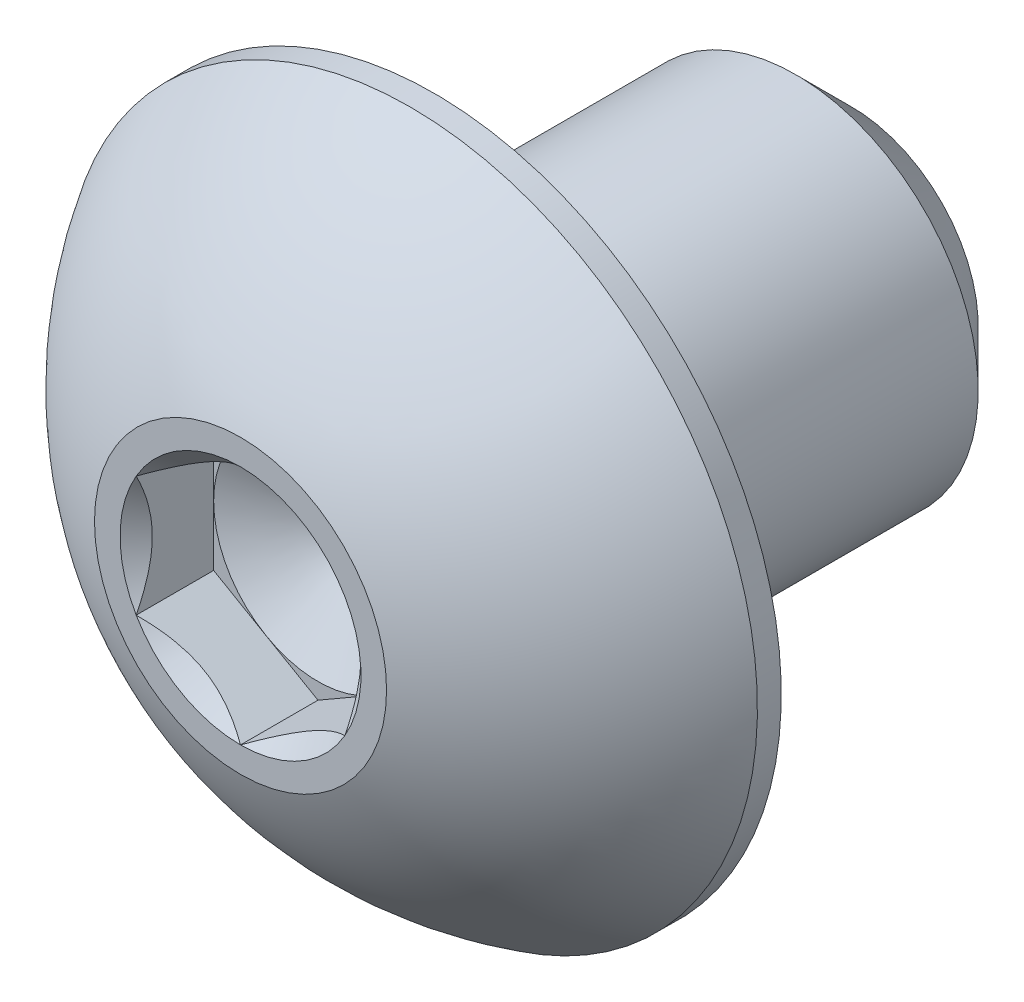
ISO-10303-21;
HEADER;
FILE_DESCRIPTION(('STEP AP214'),'2;1');
FILE_NAME('part.step','',(''),(''),'','','');
FILE_SCHEMA(('AUTOMOTIVE_DESIGN { 1 0 10303 214 1 1 1 1 }'));
ENDSEC;
DATA;
#1=APPLICATION_CONTEXT('core data for automotive mechanical design processes');
#2=APPLICATION_PROTOCOL_DEFINITION('international standard','automotive_design',2000,#1);
#3=PRODUCT_CONTEXT('',#1,'mechanical');
#4=PRODUCT('Part','Part','',(#3));
#5=PRODUCT_RELATED_PRODUCT_CATEGORY('part','',(#4));
#6=PRODUCT_DEFINITION_FORMATION('','',#4);
#7=PRODUCT_DEFINITION_CONTEXT('part definition',#1,'design');
#8=PRODUCT_DEFINITION('design','',#6,#7);
#9=PRODUCT_DEFINITION_SHAPE('','',#8);
#10=(LENGTH_UNIT() NAMED_UNIT(*) SI_UNIT(.MILLI.,.METRE.));
#11=(NAMED_UNIT(*) PLANE_ANGLE_UNIT() SI_UNIT($,.RADIAN.));
#12=(NAMED_UNIT(*) SI_UNIT($,.STERADIAN.) SOLID_ANGLE_UNIT());
#13=UNCERTAINTY_MEASURE_WITH_UNIT(LENGTH_MEASURE(1.E-05),#10,'distance_accuracy_value','');
#14=(GEOMETRIC_REPRESENTATION_CONTEXT(3) GLOBAL_UNCERTAINTY_ASSIGNED_CONTEXT((#13)) GLOBAL_UNIT_ASSIGNED_CONTEXT((#10,
#11,#12)) REPRESENTATION_CONTEXT('',''));
#15=CARTESIAN_POINT('',(0.,0.,0.));
#16=DIRECTION('',(0.,0.,1.));
#17=DIRECTION('',(1.,0.,0.));
#18=AXIS2_PLACEMENT_3D('',#15,#16,#17);
#19=CARTESIAN_POINT('',(0.,0.,3.48615));
#20=DIRECTION('',(0.,0.,1.));
#21=DIRECTION('',(1.,0.,0.));
#22=AXIS2_PLACEMENT_3D('',#19,#20,#21);
#23=CONICAL_SURFACE('',#22,1.3748153285078,0.78539816339745);
#24=CARTESIAN_POINT('',(0.,0.,3.48615));
#25=DIRECTION('',(0.,0.,1.));
#26=DIRECTION('',(1.,0.,0.));
#27=AXIS2_PLACEMENT_3D('',#24,#25,#26);
#28=CIRCLE('',#27,1.3748153285078);
#29=CARTESIAN_POINT('',(1.190625,0.687407664253897,3.48615));
#30=VERTEX_POINT('',#29);
#31=CARTESIAN_POINT('',(0.,1.3748153285078,3.48615));
#32=VERTEX_POINT('',#31);
#33=EDGE_CURVE('E199',#30,#32,#28,.T.);
#34=ORIENTED_EDGE('',*,*,#33,.T.);
#35=CARTESIAN_POINT('',(1.19062499999999,0.687407664253902,3.48615));
#36=CARTESIAN_POINT('',(0.5953125,1.03111149638085,3.14244616787305));
#37=CARTESIAN_POINT('',(0.,1.37481532850779,3.48614999999999));
#38=(BOUNDED_CURVE() B_SPLINE_CURVE(2,(#35,#36,#37),.UNSPECIFIED.,.F.,
.F.) B_SPLINE_CURVE_WITH_KNOTS((3,3),(-0.347424905127769,-0.126894256957088),
.UNSPECIFIED.) CURVE() GEOMETRIC_REPRESENTATION_ITEM() RATIONAL_B_SPLINE_CURVE((1.3897966321367,
1.60479891936591,1.3897966321367)) REPRESENTATION_ITEM(''));
#39=EDGE_CURVE('E157',#30,#32,#38,.T.);
#40=ORIENTED_EDGE('',*,*,#39,.F.);
#41=EDGE_LOOP('',(#34,#40));
#42=FACE_BOUND('',#41,.T.);
#43=ADVANCED_FACE('F16',(#42),#23,.F.);
#44=CARTESIAN_POINT('',(0.,0.,3.48615));
#45=DIRECTION('',(0.,0.,1.));
#46=DIRECTION('',(1.,0.,0.));
#47=AXIS2_PLACEMENT_3D('',#44,#45,#46);
#48=CONICAL_SURFACE('',#47,1.3748153285078,0.78539816339745);
#49=CARTESIAN_POINT('',(0.,0.,3.48615));
#50=DIRECTION('',(0.,0.,1.));
#51=DIRECTION('',(1.,0.,0.));
#52=AXIS2_PLACEMENT_3D('',#49,#50,#51);
#53=CIRCLE('',#52,1.3748153285078);
#54=CARTESIAN_POINT('',(0.,-1.3748153285078,3.48615));
#55=VERTEX_POINT('',#54);
#56=CARTESIAN_POINT('',(1.190625,-0.687407664253897,3.48615));
#57=VERTEX_POINT('',#56);
#58=EDGE_CURVE('E190',#55,#57,#53,.T.);
#59=ORIENTED_EDGE('',*,*,#58,.T.);
#60=CARTESIAN_POINT('',(0.,-1.37481532850779,3.48614999999999));
#61=CARTESIAN_POINT('',(0.595312500000001,-1.03111149638085,3.14244616787305));
#62=CARTESIAN_POINT('',(1.19062499999999,-0.687407664253902,3.48614999999999));
#63=(BOUNDED_CURVE() B_SPLINE_CURVE(2,(#60,#61,#62),.UNSPECIFIED.,.F.,
.F.) B_SPLINE_CURVE_WITH_KNOTS((3,3),(-0.347424905127768,-0.126894256957088),
.UNSPECIFIED.) CURVE() GEOMETRIC_REPRESENTATION_ITEM() RATIONAL_B_SPLINE_CURVE((1.3897966321367,
1.60479891936591,1.3897966321367)) REPRESENTATION_ITEM(''));
#64=EDGE_CURVE('E180',#55,#57,#63,.T.);
#65=ORIENTED_EDGE('',*,*,#64,.F.);
#66=EDGE_LOOP('',(#59,#65));
#67=FACE_BOUND('',#66,.T.);
#68=ADVANCED_FACE('F380',(#67),#48,.F.);
#69=CARTESIAN_POINT('',(0.,0.,3.48615));
#70=DIRECTION('',(0.,0.,1.));
#71=DIRECTION('',(1.,0.,0.));
#72=AXIS2_PLACEMENT_3D('',#69,#70,#71);
#73=CONICAL_SURFACE('',#72,1.3748153285078,0.78539816339745);
#74=CARTESIAN_POINT('',(0.,0.,3.48615));
#75=DIRECTION('',(0.,0.,1.));
#76=DIRECTION('',(1.,0.,0.));
#77=AXIS2_PLACEMENT_3D('',#74,#75,#76);
#78=CIRCLE('',#77,1.3748153285078);
#79=CARTESIAN_POINT('',(-1.190625,-0.687407664253899,3.48615));
#80=VERTEX_POINT('',#79);
#81=EDGE_CURVE('E186',#80,#55,#78,.T.);
#82=ORIENTED_EDGE('',*,*,#81,.T.);
#83=CARTESIAN_POINT('',(-1.19062499999999,-0.687407664253904,3.48614999999999));
#84=CARTESIAN_POINT('',(-0.595312499999999,-1.03111149638085,3.14244616787305));
#85=CARTESIAN_POINT('',(0.,-1.37481532850779,3.48615));
#86=(BOUNDED_CURVE() B_SPLINE_CURVE(2,(#83,#84,#85),.UNSPECIFIED.,.F.,
.F.) B_SPLINE_CURVE_WITH_KNOTS((3,3),(-0.347424905127768,-0.126894256957088),
.UNSPECIFIED.) CURVE() GEOMETRIC_REPRESENTATION_ITEM() RATIONAL_B_SPLINE_CURVE((1.3897966321367,
1.60479891936591,1.3897966321367)) REPRESENTATION_ITEM(''));
#87=EDGE_CURVE('E147',#80,#55,#86,.T.);
#88=ORIENTED_EDGE('',*,*,#87,.F.);
#89=EDGE_LOOP('',(#82,#88));
#90=FACE_BOUND('',#89,.T.);
#91=ADVANCED_FACE('F386',(#90),#73,.F.);
#92=CARTESIAN_POINT('',(0.,0.,3.48615));
#93=DIRECTION('',(0.,0.,1.));
#94=DIRECTION('',(-1.,0.,0.));
#95=AXIS2_PLACEMENT_3D('',#92,#93,#94);
#96=CONICAL_SURFACE('',#95,1.3748153285078,0.78539816339745);
#97=CARTESIAN_POINT('',(0.,0.,3.48615));
#98=DIRECTION('',(0.,0.,1.));
#99=DIRECTION('',(1.,0.,0.));
#100=AXIS2_PLACEMENT_3D('',#97,#98,#99);
#101=CIRCLE('',#100,1.3748153285078);
#102=CARTESIAN_POINT('',(-1.190625,0.687407664253898,3.48615));
#103=VERTEX_POINT('',#102);
#104=EDGE_CURVE('E164',#103,#80,#101,.T.);
#105=ORIENTED_EDGE('',*,*,#104,.T.);
#106=CARTESIAN_POINT('',(-1.190625,0.687407664253891,3.48614999999999));
#107=CARTESIAN_POINT('',(-1.190625,0.,3.14244616787305));
#108=CARTESIAN_POINT('',(-1.190625,-0.687407664253891,3.48615));
#109=(BOUNDED_CURVE() B_SPLINE_CURVE(2,(#106,#107,#108),.UNSPECIFIED.,.F.,
.F.) B_SPLINE_CURVE_WITH_KNOTS((3,3),(-0.347424905127769,-0.126894256957088),
.UNSPECIFIED.) CURVE() GEOMETRIC_REPRESENTATION_ITEM() RATIONAL_B_SPLINE_CURVE((1.3897966321367,
1.60479891936591,1.3897966321367)) REPRESENTATION_ITEM(''));
#110=EDGE_CURVE('E261',#103,#80,#109,.T.);
#111=ORIENTED_EDGE('',*,*,#110,.F.);
#112=EDGE_LOOP('',(#105,#111));
#113=FACE_BOUND('',#112,.T.);
#114=ADVANCED_FACE('F395',(#113),#96,.F.);
#115=CARTESIAN_POINT('',(0.,0.,3.48615));
#116=DIRECTION('',(0.,0.,1.));
#117=DIRECTION('',(1.,0.,0.));
#118=AXIS2_PLACEMENT_3D('',#115,#116,#117);
#119=CONICAL_SURFACE('',#118,1.3748153285078,0.78539816339745);
#120=CARTESIAN_POINT('',(0.,0.,3.48615));
#121=DIRECTION('',(0.,0.,1.));
#122=DIRECTION('',(1.,0.,0.));
#123=AXIS2_PLACEMENT_3D('',#120,#121,#122);
#124=CIRCLE('',#123,1.3748153285078);
#125=EDGE_CURVE('E156',#32,#103,#124,.T.);
#126=ORIENTED_EDGE('',*,*,#125,.T.);
#127=CARTESIAN_POINT('',(0.,1.37481532850779,3.48614999999999));
#128=CARTESIAN_POINT('',(-0.595312500000001,1.03111149638085,3.14244616787305));
#129=CARTESIAN_POINT('',(-1.19062499999999,0.687407664253902,3.48614999999999));
#130=(BOUNDED_CURVE() B_SPLINE_CURVE(2,(#127,#128,#129),.UNSPECIFIED.,.F.,
.F.) B_SPLINE_CURVE_WITH_KNOTS((3,3),(-0.347424905127768,-0.126894256957088),
.UNSPECIFIED.) CURVE() GEOMETRIC_REPRESENTATION_ITEM() RATIONAL_B_SPLINE_CURVE((1.3897966321367,
1.60479891936591,1.3897966321367)) REPRESENTATION_ITEM(''));
#131=EDGE_CURVE('E140',#32,#103,#130,.T.);
#132=ORIENTED_EDGE('',*,*,#131,.F.);
#133=EDGE_LOOP('',(#126,#132));
#134=FACE_BOUND('',#133,.T.);
#135=ADVANCED_FACE('F392',(#134),#119,.F.);
#136=CARTESIAN_POINT('',(0.,0.,2.60223));
#137=DIRECTION('',(0.,0.,1.));
#138=DIRECTION('',(1.,0.,0.));
#139=AXIS2_PLACEMENT_3D('',#136,#137,#138);
#140=PLANE('',#139);
#141=CARTESIAN_POINT('',(0.,0.,2.60223));
#142=DIRECTION('',(0.,0.,1.));
#143=DIRECTION('',(1.,0.,0.));
#144=AXIS2_PLACEMENT_3D('',#141,#142,#143);
#145=CIRCLE('',#144,1.190625);
#146=CARTESIAN_POINT('',(1.190625,0.,2.60223));
#147=VERTEX_POINT('',#146);
#148=CARTESIAN_POINT('',(0.5953125,1.03111149638085,2.60223));
#149=VERTEX_POINT('',#148);
#150=EDGE_CURVE('E237',#147,#149,#145,.T.);
#151=ORIENTED_EDGE('',*,*,#150,.F.);
#152=DIRECTION('',(0.,1.,0.));
#153=VECTOR('',#152,1.);
#154=CARTESIAN_POINT('',(1.190625,-0.687407664253898,2.60223));
#155=LINE('',#154,#153);
#156=CARTESIAN_POINT('',(1.190625,0.687407664253899,2.60223));
#157=VERTEX_POINT('',#156);
#158=EDGE_CURVE('E27',#147,#157,#155,.T.);
#159=ORIENTED_EDGE('',*,*,#158,.T.);
#160=DIRECTION('',(-0.866025403784439,0.5,0.));
#161=VECTOR('',#160,1.);
#162=CARTESIAN_POINT('',(1.190625,0.687407664253899,2.60223));
#163=LINE('',#162,#161);
#164=EDGE_CURVE('E173',#157,#149,#163,.T.);
#165=ORIENTED_EDGE('',*,*,#164,.T.);
#166=EDGE_LOOP('',(#151,#159,#165));
#167=FACE_BOUND('',#166,.T.);
#168=ADVANCED_FACE('F339',(#167),#140,.T.);
#169=CARTESIAN_POINT('',(0.,0.,2.60223));
#170=DIRECTION('',(0.,0.,1.));
#171=DIRECTION('',(1.,0.,0.));
#172=AXIS2_PLACEMENT_3D('',#169,#170,#171);
#173=PLANE('',#172);
#174=CARTESIAN_POINT('',(0.,0.,2.60223));
#175=DIRECTION('',(0.,0.,1.));
#176=DIRECTION('',(1.,0.,0.));
#177=AXIS2_PLACEMENT_3D('',#174,#175,#176);
#178=CIRCLE('',#177,1.190625);
#179=CARTESIAN_POINT('',(-0.5953125,1.03111149638085,2.60223));
#180=VERTEX_POINT('',#179);
#181=EDGE_CURVE('E226',#149,#180,#178,.T.);
#182=ORIENTED_EDGE('',*,*,#181,.F.);
#183=DIRECTION('',(-0.866025403784439,0.5,0.));
#184=VECTOR('',#183,1.);
#185=CARTESIAN_POINT('',(1.190625,0.687407664253899,2.60223));
#186=LINE('',#185,#184);
#187=CARTESIAN_POINT('',(0.,1.3748153285078,2.60223));
#188=VERTEX_POINT('',#187);
#189=EDGE_CURVE('E177',#149,#188,#186,.T.);
#190=ORIENTED_EDGE('',*,*,#189,.T.);
#191=DIRECTION('',(-0.866025403784439,-0.5,0.));
#192=VECTOR('',#191,1.);
#193=CARTESIAN_POINT('',(0.,1.3748153285078,2.60223));
#194=LINE('',#193,#192);
#195=EDGE_CURVE('E293',#188,#180,#194,.T.);
#196=ORIENTED_EDGE('',*,*,#195,.T.);
#197=EDGE_LOOP('',(#182,#190,#196));
#198=FACE_BOUND('',#197,.T.);
#199=ADVANCED_FACE('F346',(#198),#173,.T.);
#200=CARTESIAN_POINT('',(0.,0.,2.60223));
#201=DIRECTION('',(0.,0.,1.));
#202=DIRECTION('',(1.,0.,0.));
#203=AXIS2_PLACEMENT_3D('',#200,#201,#202);
#204=PLANE('',#203);
#205=CARTESIAN_POINT('',(0.,0.,2.60223));
#206=DIRECTION('',(0.,0.,1.));
#207=DIRECTION('',(1.,0.,0.));
#208=AXIS2_PLACEMENT_3D('',#205,#206,#207);
#209=CIRCLE('',#208,1.190625);
#210=CARTESIAN_POINT('',(-1.190625,0.,2.60223));
#211=VERTEX_POINT('',#210);
#212=EDGE_CURVE('E136',#180,#211,#209,.T.);
#213=ORIENTED_EDGE('',*,*,#212,.F.);
#214=DIRECTION('',(-0.866025403784439,-0.5,0.));
#215=VECTOR('',#214,1.);
#216=CARTESIAN_POINT('',(0.,1.3748153285078,2.60223));
#217=LINE('',#216,#215);
#218=CARTESIAN_POINT('',(-1.190625,0.687407664253898,2.60223));
#219=VERTEX_POINT('',#218);
#220=EDGE_CURVE('E172',#180,#219,#217,.T.);
#221=ORIENTED_EDGE('',*,*,#220,.T.);
#222=DIRECTION('',(0.,-1.,0.));
#223=VECTOR('',#222,1.);
#224=CARTESIAN_POINT('',(-1.190625,0.687407664253898,2.60223));
#225=LINE('',#224,#223);
#226=EDGE_CURVE('E144',#219,#211,#225,.T.);
#227=ORIENTED_EDGE('',*,*,#226,.T.);
#228=EDGE_LOOP('',(#213,#221,#227));
#229=FACE_BOUND('',#228,.T.);
#230=ADVANCED_FACE('F422',(#229),#204,.T.);
#231=CARTESIAN_POINT('',(0.,0.,2.60223));
#232=DIRECTION('',(0.,0.,1.));
#233=DIRECTION('',(1.,0.,0.));
#234=AXIS2_PLACEMENT_3D('',#231,#232,#233);
#235=PLANE('',#234);
#236=CARTESIAN_POINT('',(0.,0.,2.60223));
#237=DIRECTION('',(0.,0.,1.));
#238=DIRECTION('',(1.,0.,0.));
#239=AXIS2_PLACEMENT_3D('',#236,#237,#238);
#240=CIRCLE('',#239,1.190625);
#241=CARTESIAN_POINT('',(-0.5953125,-1.03111149638085,2.60223));
#242=VERTEX_POINT('',#241);
#243=EDGE_CURVE('E241',#211,#242,#240,.T.);
#244=ORIENTED_EDGE('',*,*,#243,.F.);
#245=DIRECTION('',(0.,-1.,0.));
#246=VECTOR('',#245,1.);
#247=CARTESIAN_POINT('',(-1.190625,0.687407664253898,2.60223));
#248=LINE('',#247,#246);
#249=CARTESIAN_POINT('',(-1.190625,-0.687407664253899,2.60223));
#250=VERTEX_POINT('',#249);
#251=EDGE_CURVE('E148',#211,#250,#248,.T.);
#252=ORIENTED_EDGE('',*,*,#251,.T.);
#253=DIRECTION('',(0.866025403784439,-0.5,0.));
#254=VECTOR('',#253,1.);
#255=CARTESIAN_POINT('',(-1.190625,-0.687407664253899,2.60223));
#256=LINE('',#255,#254);
#257=EDGE_CURVE('E178',#250,#242,#256,.T.);
#258=ORIENTED_EDGE('',*,*,#257,.T.);
#259=EDGE_LOOP('',(#244,#252,#258));
#260=FACE_BOUND('',#259,.T.);
#261=ADVANCED_FACE('F354',(#260),#235,.T.);
#262=CARTESIAN_POINT('',(0.,0.,2.60223));
#263=DIRECTION('',(0.,0.,1.));
#264=DIRECTION('',(1.,0.,0.));
#265=AXIS2_PLACEMENT_3D('',#262,#263,#264);
#266=PLANE('',#265);
#267=CARTESIAN_POINT('',(0.,0.,2.60223));
#268=DIRECTION('',(0.,0.,1.));
#269=DIRECTION('',(1.,0.,0.));
#270=AXIS2_PLACEMENT_3D('',#267,#268,#269);
#271=CIRCLE('',#270,1.190625);
#272=CARTESIAN_POINT('',(0.5953125,-1.03111149638085,2.60223));
#273=VERTEX_POINT('',#272);
#274=EDGE_CURVE('E245',#242,#273,#271,.T.);
#275=ORIENTED_EDGE('',*,*,#274,.F.);
#276=DIRECTION('',(0.866025403784439,-0.5,0.));
#277=VECTOR('',#276,1.);
#278=CARTESIAN_POINT('',(-1.190625,-0.687407664253899,2.60223));
#279=LINE('',#278,#277);
#280=CARTESIAN_POINT('',(0.,-1.3748153285078,2.60223));
#281=VERTEX_POINT('',#280);
#282=EDGE_CURVE('E181',#242,#281,#279,.T.);
#283=ORIENTED_EDGE('',*,*,#282,.T.);
#284=DIRECTION('',(0.866025403784439,0.5,0.));
#285=VECTOR('',#284,1.);
#286=CARTESIAN_POINT('',(0.,-1.3748153285078,2.60223));
#287=LINE('',#286,#285);
#288=EDGE_CURVE('E194',#281,#273,#287,.T.);
#289=ORIENTED_EDGE('',*,*,#288,.T.);
#290=EDGE_LOOP('',(#275,#283,#289));
#291=FACE_BOUND('',#290,.T.);
#292=ADVANCED_FACE('F363',(#291),#266,.T.);
#293=CARTESIAN_POINT('',(0.,0.,2.60223));
#294=DIRECTION('',(0.,0.,1.));
#295=DIRECTION('',(1.,0.,0.));
#296=AXIS2_PLACEMENT_3D('',#293,#294,#295);
#297=PLANE('',#296);
#298=CARTESIAN_POINT('',(0.,0.,2.60223));
#299=DIRECTION('',(0.,0.,1.));
#300=DIRECTION('',(1.,0.,0.));
#301=AXIS2_PLACEMENT_3D('',#298,#299,#300);
#302=CIRCLE('',#301,1.190625);
#303=EDGE_CURVE('E20',#273,#147,#302,.T.);
#304=ORIENTED_EDGE('',*,*,#303,.F.);
#305=DIRECTION('',(0.866025403784439,0.5,0.));
#306=VECTOR('',#305,1.);
#307=CARTESIAN_POINT('',(0.,-1.3748153285078,2.60223));
#308=LINE('',#307,#306);
#309=CARTESIAN_POINT('',(1.190625,-0.687407664253898,2.60223));
#310=VERTEX_POINT('',#309);
#311=EDGE_CURVE('E191',#273,#310,#308,.T.);
#312=ORIENTED_EDGE('',*,*,#311,.T.);
#313=DIRECTION('',(0.,1.,0.));
#314=VECTOR('',#313,1.);
#315=CARTESIAN_POINT('',(1.190625,-0.687407664253898,2.60223));
#316=LINE('',#315,#314);
#317=EDGE_CURVE('E11',#310,#147,#316,.T.);
#318=ORIENTED_EDGE('',*,*,#317,.T.);
#319=EDGE_LOOP('',(#304,#312,#318));
#320=FACE_BOUND('',#319,.T.);
#321=ADVANCED_FACE('F334',(#320),#297,.T.);
#322=CARTESIAN_POINT('',(1.190625,-0.687407664253898,3.48615));
#323=DIRECTION('',(-1.,0.,0.));
#324=DIRECTION('',(0.,1.,0.));
#325=AXIS2_PLACEMENT_3D('',#322,#323,#324);
#326=PLANE('',#325);
#327=CARTESIAN_POINT('',(1.190625,-0.687407664253888,3.48614999999999));
#328=CARTESIAN_POINT('',(1.190625,0.,3.14244616787306));
#329=CARTESIAN_POINT('',(1.190625,0.687407664253887,3.48614999999999));
#330=(BOUNDED_CURVE() B_SPLINE_CURVE(2,(#327,#328,#329),.UNSPECIFIED.,.F.,
.F.) B_SPLINE_CURVE_WITH_KNOTS((3,3),(0.126894256957089,0.347424905127768),
.UNSPECIFIED.) CURVE() GEOMETRIC_REPRESENTATION_ITEM() RATIONAL_B_SPLINE_CURVE((1.3897966321367,
1.60479891936591,1.3897966321367)) REPRESENTATION_ITEM(''));
#331=EDGE_CURVE('E208',#57,#30,#330,.T.);
#332=ORIENTED_EDGE('',*,*,#331,.T.);
#333=DIRECTION('',(0.,0.,-1.));
#334=VECTOR('',#333,1.);
#335=CARTESIAN_POINT('',(1.190625,0.687407664253899,3.48615));
#336=LINE('',#335,#334);
#337=EDGE_CURVE('E176',#30,#157,#336,.T.);
#338=ORIENTED_EDGE('',*,*,#337,.T.);
#339=ORIENTED_EDGE('',*,*,#158,.F.);
#340=ORIENTED_EDGE('',*,*,#317,.F.);
#341=DIRECTION('',(0.,0.,-1.));
#342=VECTOR('',#341,1.);
#343=CARTESIAN_POINT('',(1.190625,-0.687407664253898,3.48615));
#344=LINE('',#343,#342);
#345=EDGE_CURVE('E195',#57,#310,#344,.T.);
#346=ORIENTED_EDGE('',*,*,#345,.F.);
#347=EDGE_LOOP('',(#332,#338,#339,#340,#346));
#348=FACE_BOUND('',#347,.T.);
#349=ADVANCED_FACE('F336',(#348),#326,.T.);
#350=CARTESIAN_POINT('',(0.,-1.3748153285078,3.48615));
#351=DIRECTION('',(-0.5,0.866025403784439,0.));
#352=DIRECTION('',(0.,0.,1.));
#353=AXIS2_PLACEMENT_3D('',#350,#351,#352);
#354=PLANE('',#353);
#355=ORIENTED_EDGE('',*,*,#64,.T.);
#356=ORIENTED_EDGE('',*,*,#345,.T.);
#357=ORIENTED_EDGE('',*,*,#311,.F.);
#358=ORIENTED_EDGE('',*,*,#288,.F.);
#359=DIRECTION('',(0.,0.,-1.));
#360=VECTOR('',#359,1.);
#361=CARTESIAN_POINT('',(0.,-1.3748153285078,3.48615));
#362=LINE('',#361,#360);
#363=EDGE_CURVE('E216',#55,#281,#362,.T.);
#364=ORIENTED_EDGE('',*,*,#363,.F.);
#365=EDGE_LOOP('',(#355,#356,#357,#358,#364));
#366=FACE_BOUND('',#365,.T.);
#367=ADVANCED_FACE('F365',(#366),#354,.T.);
#368=CARTESIAN_POINT('',(-1.190625,-0.687407664253899,3.48615));
#369=DIRECTION('',(0.5,0.866025403784439,0.));
#370=DIRECTION('',(0.,0.,-1.));
#371=AXIS2_PLACEMENT_3D('',#368,#369,#370);
#372=PLANE('',#371);
#373=ORIENTED_EDGE('',*,*,#87,.T.);
#374=ORIENTED_EDGE('',*,*,#363,.T.);
#375=ORIENTED_EDGE('',*,*,#282,.F.);
#376=ORIENTED_EDGE('',*,*,#257,.F.);
#377=DIRECTION('',(0.,0.,-1.));
#378=VECTOR('',#377,1.);
#379=CARTESIAN_POINT('',(-1.190625,-0.687407664253899,3.48615));
#380=LINE('',#379,#378);
#381=EDGE_CURVE('E257',#80,#250,#380,.T.);
#382=ORIENTED_EDGE('',*,*,#381,.F.);
#383=EDGE_LOOP('',(#373,#374,#375,#376,#382));
#384=FACE_BOUND('',#383,.T.);
#385=ADVANCED_FACE('F360',(#384),#372,.T.);
#386=CARTESIAN_POINT('',(-1.190625,0.687407664253898,3.48615));
#387=DIRECTION('',(1.,0.,0.));
#388=DIRECTION('',(0.,1.,0.));
#389=AXIS2_PLACEMENT_3D('',#386,#387,#388);
#390=PLANE('',#389);
#391=ORIENTED_EDGE('',*,*,#110,.T.);
#392=ORIENTED_EDGE('',*,*,#381,.T.);
#393=ORIENTED_EDGE('',*,*,#251,.F.);
#394=ORIENTED_EDGE('',*,*,#226,.F.);
#395=DIRECTION('',(0.,0.,-1.));
#396=VECTOR('',#395,1.);
#397=CARTESIAN_POINT('',(-1.190625,0.687407664253898,3.48615));
#398=LINE('',#397,#396);
#399=EDGE_CURVE('E165',#103,#219,#398,.T.);
#400=ORIENTED_EDGE('',*,*,#399,.F.);
#401=EDGE_LOOP('',(#391,#392,#393,#394,#400));
#402=FACE_BOUND('',#401,.T.);
#403=ADVANCED_FACE('F416',(#402),#390,.T.);
#404=CARTESIAN_POINT('',(0.,1.3748153285078,3.48615));
#405=DIRECTION('',(0.5,-0.866025403784439,0.));
#406=DIRECTION('',(0.,0.,-1.));
#407=AXIS2_PLACEMENT_3D('',#404,#405,#406);
#408=PLANE('',#407);
#409=ORIENTED_EDGE('',*,*,#131,.T.);
#410=ORIENTED_EDGE('',*,*,#399,.T.);
#411=ORIENTED_EDGE('',*,*,#220,.F.);
#412=ORIENTED_EDGE('',*,*,#195,.F.);
#413=DIRECTION('',(0.,0.,-1.));
#414=VECTOR('',#413,1.);
#415=CARTESIAN_POINT('',(0.,1.3748153285078,3.48615));
#416=LINE('',#415,#414);
#417=EDGE_CURVE('E163',#32,#188,#416,.T.);
#418=ORIENTED_EDGE('',*,*,#417,.F.);
#419=EDGE_LOOP('',(#409,#410,#411,#412,#418));
#420=FACE_BOUND('',#419,.T.);
#421=ADVANCED_FACE('F18',(#420),#408,.T.);
#422=CARTESIAN_POINT('',(1.190625,0.687407664253899,3.48615));
#423=DIRECTION('',(-0.5,-0.866025403784439,0.));
#424=DIRECTION('',(-0.866025403784439,0.5,0.));
#425=AXIS2_PLACEMENT_3D('',#422,#423,#424);
#426=PLANE('',#425);
#427=ORIENTED_EDGE('',*,*,#39,.T.);
#428=ORIENTED_EDGE('',*,*,#417,.T.);
#429=ORIENTED_EDGE('',*,*,#189,.F.);
#430=ORIENTED_EDGE('',*,*,#164,.F.);
#431=ORIENTED_EDGE('',*,*,#337,.F.);
#432=EDGE_LOOP('',(#427,#428,#429,#430,#431));
#433=FACE_BOUND('',#432,.T.);
#434=ADVANCED_FACE('F343',(#433),#426,.T.);
#435=CARTESIAN_POINT('',(0.,3.9624,1.27635));
#436=DIRECTION('',(0.,0.,1.));
#437=DIRECTION('',(1.,0.,0.));
#438=AXIS2_PLACEMENT_3D('',#435,#436,#437);
#439=PLANE('',#438);
#440=CARTESIAN_POINT('',(0.,0.,1.27635));
#441=DIRECTION('',(0.,0.,1.));
#442=DIRECTION('',(1.,0.,0.));
#443=AXIS2_PLACEMENT_3D('',#440,#441,#442);
#444=CIRCLE('',#443,2.0828);
#445=CARTESIAN_POINT('',(-2.0828,0.,1.27635));
#446=VERTEX_POINT('',#445);
#447=EDGE_CURVE('E232',#446,#446,#444,.T.);
#448=ORIENTED_EDGE('',*,*,#447,.T.);
#449=EDGE_LOOP('',(#448));
#450=FACE_BOUND('',#449,.T.);
#451=CARTESIAN_POINT('',(0.,0.,1.27635));
#452=DIRECTION('',(0.,0.,1.));
#453=DIRECTION('',(1.,0.,0.));
#454=AXIS2_PLACEMENT_3D('',#451,#452,#453);
#455=CIRCLE('',#454,3.9624);
#456=CARTESIAN_POINT('',(-3.9624,0.,1.27635));
#457=VERTEX_POINT('',#456);
#458=EDGE_CURVE('E132',#457,#457,#455,.T.);
#459=ORIENTED_EDGE('',*,*,#458,.F.);
#460=EDGE_LOOP('',(#459));
#461=FACE_BOUND('',#460,.T.);
#462=ADVANCED_FACE('F415',(#450,#461),#439,.F.);
#463=CARTESIAN_POINT('',(0.,1.190625,3.48615));
#464=DIRECTION('',(0.,0.,-1.));
#465=DIRECTION('',(0.,-1.,0.));
#466=AXIS2_PLACEMENT_3D('',#463,#464,#465);
#467=PLANE('',#466);
#468=ORIENTED_EDGE('',*,*,#125,.F.);
#469=ORIENTED_EDGE('',*,*,#33,.F.);
#470=CARTESIAN_POINT('',(0.,0.,3.48615));
#471=DIRECTION('',(0.,0.,1.));
#472=DIRECTION('',(1.,0.,0.));
#473=AXIS2_PLACEMENT_3D('',#470,#471,#472);
#474=CIRCLE('',#473,1.3748153285078);
#475=EDGE_CURVE('E203',#57,#30,#474,.T.);
#476=ORIENTED_EDGE('',*,*,#475,.F.);
#477=ORIENTED_EDGE('',*,*,#58,.F.);
#478=ORIENTED_EDGE('',*,*,#81,.F.);
#479=ORIENTED_EDGE('',*,*,#104,.F.);
#480=EDGE_LOOP('',(#468,#469,#476,#477,#478,#479));
#481=FACE_BOUND('',#480,.T.);
#482=CARTESIAN_POINT('',(0.,0.,3.48615));
#483=DIRECTION('',(0.,0.,1.));
#484=DIRECTION('',(1.,0.,0.));
#485=AXIS2_PLACEMENT_3D('',#482,#483,#484);
#486=CIRCLE('',#485,1.666875);
#487=CARTESIAN_POINT('',(0.,1.666875,3.48615));
#488=VERTEX_POINT('',#487);
#489=EDGE_CURVE('E120',#488,#488,#486,.T.);
#490=ORIENTED_EDGE('',*,*,#489,.T.);
#491=EDGE_LOOP('',(#490));
#492=FACE_BOUND('',#491,.T.);
#493=ADVANCED_FACE('F121',(#481,#492),#467,.F.);
#494=CARTESIAN_POINT('',(0.,0.,3.48615));
#495=DIRECTION('',(0.,0.,1.));
#496=DIRECTION('',(1.,0.,0.));
#497=AXIS2_PLACEMENT_3D('',#494,#495,#496);
#498=CYLINDRICAL_SURFACE('',#497,3.9624);
#499=CARTESIAN_POINT('',(0.,0.,1.54849285714286));
#500=DIRECTION('',(0.,0.,1.));
#501=DIRECTION('',(1.,0.,0.));
#502=AXIS2_PLACEMENT_3D('',#499,#500,#501);
#503=CIRCLE('',#502,3.9624);
#504=CARTESIAN_POINT('',(-3.9624,0.,1.54849285714286));
#505=VERTEX_POINT('',#504);
#506=EDGE_CURVE('E125',#505,#505,#503,.T.);
#507=ORIENTED_EDGE('',*,*,#506,.F.);
#508=DIRECTION('',(0.,0.,-1.));
#509=VECTOR('',#508,1.);
#510=CARTESIAN_POINT('',(-3.9624,0.,3.48615));
#511=LINE('',#510,#509);
#512=EDGE_CURVE('E124',#505,#457,#511,.T.);
#513=ORIENTED_EDGE('',*,*,#512,.T.);
#514=ORIENTED_EDGE('',*,*,#458,.T.);
#515=ORIENTED_EDGE('',*,*,#512,.F.);
#516=EDGE_LOOP('',(#507,#513,#514,#515));
#517=FACE_BOUND('',#516,.T.);
#518=ADVANCED_FACE('F402',(#517),#498,.T.);
#519=CARTESIAN_POINT('',(0.,0.,-0.817154317566213));
#520=DIRECTION('',(-1.,0.,0.));
#521=DIRECTION('',(0.,1.,0.));
#522=AXIS2_PLACEMENT_3D('',#519,#520,#521);
#523=SPHERICAL_SURFACE('',#522,4.61485647828933);
#524=CARTESIAN_POINT('',(0.,0.,-0.817154317566213));
#525=DIRECTION('',(0.,0.,1.));
#526=DIRECTION('',(1.,0.,0.));
#527=AXIS2_PLACEMENT_3D('',#524,#525,#526);
#528=SPHERICAL_SURFACE('',#527,4.61485647828933);
#529=ORIENTED_EDGE('',*,*,#489,.F.);
#530=EDGE_LOOP('',(#529));
#531=FACE_BOUND('',#530,.T.);
#532=ORIENTED_EDGE('',*,*,#506,.T.);
#533=EDGE_LOOP('',(#532));
#534=FACE_BOUND('',#533,.T.);
#535=ADVANCED_FACE('F405',(#531,#534),#528,.T.);
#536=CARTESIAN_POINT('',(0.,0.,2.60223));
#537=DIRECTION('',(0.,0.,1.));
#538=DIRECTION('',(1.,0.,0.));
#539=AXIS2_PLACEMENT_3D('',#536,#537,#538);
#540=CONICAL_SURFACE('',#539,1.190625,1.0471975511966);
#541=DIRECTION('',(-0.86602540378444,0.,0.5));
#542=VECTOR('',#541,1.);
#543=CARTESIAN_POINT('',(-1.190625,0.,2.60223));
#544=LINE('',#543,#542);
#545=CARTESIAN_POINT('',(0.,0.,1.9148223357461));
#546=VERTEX_POINT('',#545);
#547=EDGE_CURVE('E207',#546,#211,#544,.T.);
#548=ORIENTED_EDGE('',*,*,#547,.T.);
#549=ORIENTED_EDGE('',*,*,#243,.T.);
#550=ORIENTED_EDGE('',*,*,#274,.T.);
#551=ORIENTED_EDGE('',*,*,#303,.T.);
#552=ORIENTED_EDGE('',*,*,#150,.T.);
#553=ORIENTED_EDGE('',*,*,#181,.T.);
#554=ORIENTED_EDGE('',*,*,#212,.T.);
#555=ORIENTED_EDGE('',*,*,#547,.F.);
#556=EDGE_LOOP('',(#548,#549,#550,#551,#552,#553,#554,#555));
#557=FACE_BOUND('',#556,.T.);
#558=ADVANCED_FACE('F331',(#557),#540,.F.);
#559=CARTESIAN_POINT('',(0.,0.,3.48615));
#560=DIRECTION('',(0.,0.,1.));
#561=DIRECTION('',(1.,0.,0.));
#562=AXIS2_PLACEMENT_3D('',#559,#560,#561);
#563=CONICAL_SURFACE('',#562,1.3748153285078,0.78539816339745);
#564=ORIENTED_EDGE('',*,*,#331,.F.);
#565=ORIENTED_EDGE('',*,*,#475,.T.);
#566=EDGE_LOOP('',(#564,#565));
#567=FACE_BOUND('',#566,.T.);
#568=ADVANCED_FACE('F369',(#567),#563,.F.);
#569=CARTESIAN_POINT('',(0.,1.4874875,-3.48615));
#570=DIRECTION('',(0.,0.,1.));
#571=DIRECTION('',(1.,0.,0.));
#572=AXIS2_PLACEMENT_3D('',#569,#570,#571);
#573=PLANE('',#572);
#574=CARTESIAN_POINT('',(0.,0.,-3.48615));
#575=DIRECTION('',(0.,0.,1.));
#576=DIRECTION('',(1.,0.,0.));
#577=AXIS2_PLACEMENT_3D('',#574,#575,#576);
#578=CIRCLE('',#577,1.4478);
#579=CARTESIAN_POINT('',(-1.4478,0.,-3.48615));
#580=VERTEX_POINT('',#579);
#581=EDGE_CURVE('E149',#580,#580,#578,.T.);
#582=ORIENTED_EDGE('',*,*,#581,.F.);
#583=EDGE_LOOP('',(#582));
#584=FACE_BOUND('',#583,.T.);
#585=ADVANCED_FACE('F399',(#584),#573,.F.);
#586=CARTESIAN_POINT('',(0.,0.,3.48615));
#587=DIRECTION('',(0.,0.,1.));
#588=DIRECTION('',(1.,0.,0.));
#589=AXIS2_PLACEMENT_3D('',#586,#587,#588);
#590=CYLINDRICAL_SURFACE('',#589,2.0828);
#591=ORIENTED_EDGE('',*,*,#447,.F.);
#592=DIRECTION('',(0.,0.,-1.));
#593=VECTOR('',#592,1.);
#594=CARTESIAN_POINT('',(-2.0828,0.,3.48615));
#595=LINE('',#594,#593);
#596=CARTESIAN_POINT('',(-2.0828,0.,-2.85115));
#597=VERTEX_POINT('',#596);
#598=EDGE_CURVE('E236',#446,#597,#595,.T.);
#599=ORIENTED_EDGE('',*,*,#598,.T.);
#600=CARTESIAN_POINT('',(0.,0.,-2.85115));
#601=DIRECTION('',(0.,0.,-1.));
#602=DIRECTION('',(1.,0.,0.));
#603=AXIS2_PLACEMENT_3D('',#600,#601,#602);
#604=CIRCLE('',#603,2.0828);
#605=EDGE_CURVE('E215',#597,#597,#604,.T.);
#606=ORIENTED_EDGE('',*,*,#605,.F.);
#607=ORIENTED_EDGE('',*,*,#598,.F.);
#608=EDGE_LOOP('',(#591,#599,#606,#607));
#609=FACE_BOUND('',#608,.T.);
#610=ADVANCED_FACE('F316',(#609),#590,.T.);
#611=CARTESIAN_POINT('',(0.,0.,-3.16865));
#612=DIRECTION('',(0.,0.,1.));
#613=DIRECTION('',(1.,0.,0.));
#614=AXIS2_PLACEMENT_3D('',#611,#612,#613);
#615=CONICAL_SURFACE('',#614,1.7653,0.785398163397448);
#616=ORIENTED_EDGE('',*,*,#581,.T.);
#617=DIRECTION('',(-0.707106781186548,0.,0.707106781186548));
#618=VECTOR('',#617,1.);
#619=CARTESIAN_POINT('',(-1.7653,0.,-3.16865));
#620=LINE('',#619,#618);
#621=EDGE_CURVE('E152',#580,#597,#620,.T.);
#622=ORIENTED_EDGE('',*,*,#621,.T.);
#623=ORIENTED_EDGE('',*,*,#605,.T.);
#624=ORIENTED_EDGE('',*,*,#621,.F.);
#625=EDGE_LOOP('',(#616,#622,#623,#624));
#626=FACE_BOUND('',#625,.T.);
#627=ADVANCED_FACE('F318',(#626),#615,.T.);
#628=CLOSED_SHELL('',(#43,#68,#91,#114,#135,#168,#199,#230,#261,#292,#321,#349,#367,#385,#403,
#421,#434,#462,#493,#518,#535,#558,#568,#585,#610,#627));
#629=MANIFOLD_SOLID_BREP('B1',#628);
#630=ADVANCED_BREP_SHAPE_REPRESENTATION('',(#18,#629),#14);
#631=SHAPE_DEFINITION_REPRESENTATION(#9,#630);
ENDSEC;
END-ISO-10303-21;
